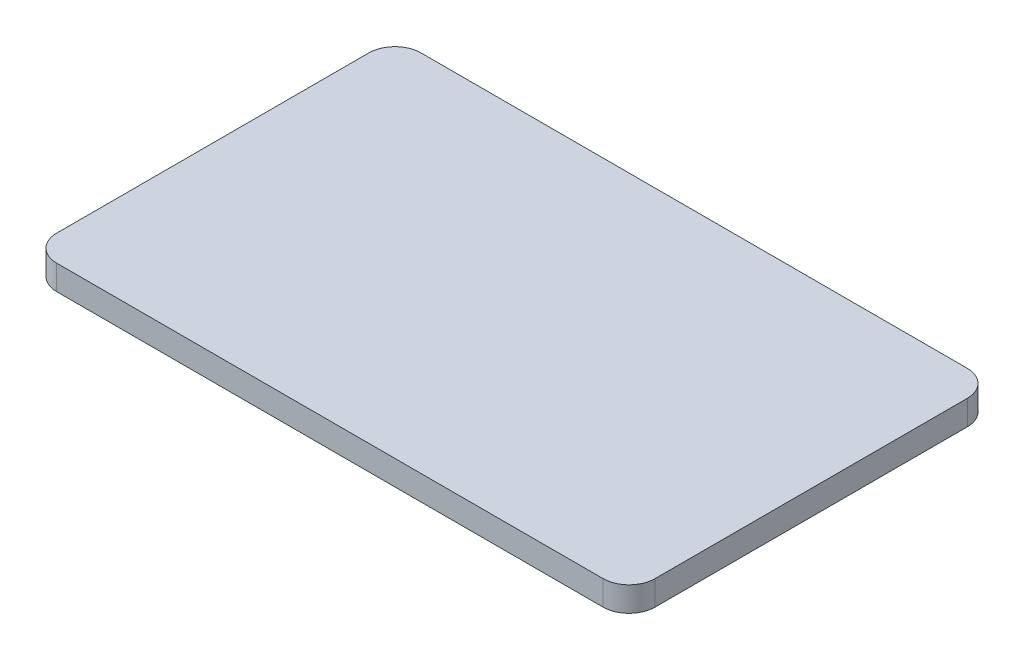
ISO-10303-21;
HEADER;
FILE_DESCRIPTION(('STEP AP214'),'2;1');
FILE_NAME('part.step','',(''),(''),'','','');
FILE_SCHEMA(('AUTOMOTIVE_DESIGN { 1 0 10303 214 1 1 1 1 }'));
ENDSEC;
DATA;
#1=APPLICATION_CONTEXT('core data for automotive mechanical design processes');
#2=APPLICATION_PROTOCOL_DEFINITION('international standard','automotive_design',2000,#1);
#3=PRODUCT_CONTEXT('',#1,'mechanical');
#4=PRODUCT('Part','Part','',(#3));
#5=PRODUCT_RELATED_PRODUCT_CATEGORY('part','',(#4));
#6=PRODUCT_DEFINITION_FORMATION('','',#4);
#7=PRODUCT_DEFINITION_CONTEXT('part definition',#1,'design');
#8=PRODUCT_DEFINITION('design','',#6,#7);
#9=PRODUCT_DEFINITION_SHAPE('','',#8);
#10=(LENGTH_UNIT() NAMED_UNIT(*) SI_UNIT(.MILLI.,.METRE.));
#11=(NAMED_UNIT(*) PLANE_ANGLE_UNIT() SI_UNIT($,.RADIAN.));
#12=(NAMED_UNIT(*) SI_UNIT($,.STERADIAN.) SOLID_ANGLE_UNIT());
#13=UNCERTAINTY_MEASURE_WITH_UNIT(LENGTH_MEASURE(1.E-05),#10,'distance_accuracy_value','');
#14=(GEOMETRIC_REPRESENTATION_CONTEXT(3) GLOBAL_UNCERTAINTY_ASSIGNED_CONTEXT((#13)) GLOBAL_UNIT_ASSIGNED_CONTEXT((#10,
#11,#12)) REPRESENTATION_CONTEXT('',''));
#15=CARTESIAN_POINT('',(0.,0.,0.));
#16=DIRECTION('',(0.,0.,1.));
#17=DIRECTION('',(1.,0.,0.));
#18=AXIS2_PLACEMENT_3D('',#15,#16,#17);
#19=CARTESIAN_POINT('',(0.,1.3,0.));
#20=DIRECTION('',(0.,1.,0.));
#21=DIRECTION('',(0.,0.,1.));
#22=AXIS2_PLACEMENT_3D('',#19,#20,#21);
#23=PLANE('',#22);
#24=DIRECTION('',(0.,0.,1.));
#25=VECTOR('',#24,1.);
#26=CARTESIAN_POINT('',(2.3,1.3,1.2));
#27=LINE('',#26,#25);
#28=CARTESIAN_POINT('',(2.3,1.3,1.2));
#29=VERTEX_POINT('',#28);
#30=CARTESIAN_POINT('',(2.3,1.3,-1.2));
#31=VERTEX_POINT('',#30);
#32=EDGE_CURVE('E108',#29,#31,#27,.F.);
#33=ORIENTED_EDGE('',*,*,#32,.T.);
#34=CARTESIAN_POINT('',(2.1,1.3,-1.2));
#35=DIRECTION('',(0.,-1.,0.));
#36=DIRECTION('',(0.,0.,-1.));
#37=AXIS2_PLACEMENT_3D('',#34,#35,#36);
#38=CIRCLE('',#37,0.2);
#39=CARTESIAN_POINT('',(2.1,1.3,-1.4));
#40=VERTEX_POINT('',#39);
#41=EDGE_CURVE('E110',#40,#31,#38,.T.);
#42=ORIENTED_EDGE('',*,*,#41,.F.);
#43=DIRECTION('',(1.,0.,0.));
#44=VECTOR('',#43,1.);
#45=CARTESIAN_POINT('',(2.1,1.3,-1.4));
#46=LINE('',#45,#44);
#47=CARTESIAN_POINT('',(-2.1,1.3,-1.4));
#48=VERTEX_POINT('',#47);
#49=EDGE_CURVE('E105',#40,#48,#46,.F.);
#50=ORIENTED_EDGE('',*,*,#49,.T.);
#51=CARTESIAN_POINT('',(-2.1,1.3,-1.2));
#52=DIRECTION('',(0.,-1.,0.));
#53=DIRECTION('',(0.,0.,-1.));
#54=AXIS2_PLACEMENT_3D('',#51,#52,#53);
#55=CIRCLE('',#54,0.2);
#56=CARTESIAN_POINT('',(-2.3,1.3,-1.2));
#57=VERTEX_POINT('',#56);
#58=EDGE_CURVE('E92',#57,#48,#55,.T.);
#59=ORIENTED_EDGE('',*,*,#58,.F.);
#60=DIRECTION('',(0.,0.,-1.));
#61=VECTOR('',#60,1.);
#62=CARTESIAN_POINT('',(-2.3,1.3,-1.2));
#63=LINE('',#62,#61);
#64=CARTESIAN_POINT('',(-2.3,1.3,1.2));
#65=VERTEX_POINT('',#64);
#66=EDGE_CURVE('E88',#57,#65,#63,.F.);
#67=ORIENTED_EDGE('',*,*,#66,.T.);
#68=CARTESIAN_POINT('',(-2.1,1.3,1.2));
#69=DIRECTION('',(0.,-1.,0.));
#70=DIRECTION('',(0.,0.,-1.));
#71=AXIS2_PLACEMENT_3D('',#68,#69,#70);
#72=CIRCLE('',#71,0.2);
#73=CARTESIAN_POINT('',(-2.1,1.3,1.4));
#74=VERTEX_POINT('',#73);
#75=EDGE_CURVE('E20',#74,#65,#72,.T.);
#76=ORIENTED_EDGE('',*,*,#75,.F.);
#77=DIRECTION('',(-1.,0.,0.));
#78=VECTOR('',#77,1.);
#79=CARTESIAN_POINT('',(-2.1,1.3,1.4));
#80=LINE('',#79,#78);
#81=CARTESIAN_POINT('',(2.1,1.3,1.4));
#82=VERTEX_POINT('',#81);
#83=EDGE_CURVE('E101',#74,#82,#80,.F.);
#84=ORIENTED_EDGE('',*,*,#83,.T.);
#85=CARTESIAN_POINT('',(2.1,1.3,1.2));
#86=DIRECTION('',(0.,-1.,0.));
#87=DIRECTION('',(0.,0.,-1.));
#88=AXIS2_PLACEMENT_3D('',#85,#86,#87);
#89=CIRCLE('',#88,0.2);
#90=EDGE_CURVE('E112',#29,#82,#89,.T.);
#91=ORIENTED_EDGE('',*,*,#90,.F.);
#92=EDGE_LOOP('',(#33,#42,#50,#59,#67,#76,#84,#91));
#93=FACE_BOUND('',#92,.T.);
#94=ADVANCED_FACE('F17',(#93),#23,.T.);
#95=CARTESIAN_POINT('',(-2.3,7.985164807135,-1.2));
#96=DIRECTION('',(1.,0.,0.));
#97=DIRECTION('',(0.,0.,-1.));
#98=AXIS2_PLACEMENT_3D('',#95,#96,#97);
#99=PLANE('',#98);
#100=DIRECTION('',(0.,-1.,0.));
#101=VECTOR('',#100,1.);
#102=CARTESIAN_POINT('',(-2.3,7.985164807135,-1.2));
#103=LINE('',#102,#101);
#104=CARTESIAN_POINT('',(-2.3,1.11,-1.2));
#105=VERTEX_POINT('',#104);
#106=EDGE_CURVE('E136',#105,#57,#103,.F.);
#107=ORIENTED_EDGE('',*,*,#106,.F.);
#108=DIRECTION('',(0.,0.,1.));
#109=VECTOR('',#108,1.);
#110=CARTESIAN_POINT('',(-2.3,1.11,-1.2));
#111=LINE('',#110,#109);
#112=CARTESIAN_POINT('',(-2.3,1.11,1.2));
#113=VERTEX_POINT('',#112);
#114=EDGE_CURVE('E99',#105,#113,#111,.T.);
#115=ORIENTED_EDGE('',*,*,#114,.T.);
#116=DIRECTION('',(0.,-1.,0.));
#117=VECTOR('',#116,1.);
#118=CARTESIAN_POINT('',(-2.3,7.985164807135,1.2));
#119=LINE('',#118,#117);
#120=EDGE_CURVE('E85',#65,#113,#119,.T.);
#121=ORIENTED_EDGE('',*,*,#120,.F.);
#122=ORIENTED_EDGE('',*,*,#66,.F.);
#123=EDGE_LOOP('',(#107,#115,#121,#122));
#124=FACE_BOUND('',#123,.T.);
#125=ADVANCED_FACE('F98',(#124),#99,.F.);
#126=CARTESIAN_POINT('',(-2.1,7.985164807135,1.2));
#127=DIRECTION('',(0.,-1.,0.));
#128=DIRECTION('',(0.,0.,-1.));
#129=AXIS2_PLACEMENT_3D('',#126,#127,#128);
#130=CYLINDRICAL_SURFACE('',#129,0.2);
#131=CARTESIAN_POINT('',(-2.1,1.11,1.2));
#132=DIRECTION('',(0.,-1.,0.));
#133=DIRECTION('',(0.,0.,-1.));
#134=AXIS2_PLACEMENT_3D('',#131,#132,#133);
#135=CIRCLE('',#134,0.2);
#136=CARTESIAN_POINT('',(-2.1,1.11,1.4));
#137=VERTEX_POINT('',#136);
#138=EDGE_CURVE('E122',#113,#137,#135,.F.);
#139=ORIENTED_EDGE('',*,*,#138,.T.);
#140=DIRECTION('',(0.,1.,0.));
#141=VECTOR('',#140,1.);
#142=CARTESIAN_POINT('',(-2.1,7.985164807135,1.4));
#143=LINE('',#142,#141);
#144=EDGE_CURVE('E87',#137,#74,#143,.T.);
#145=ORIENTED_EDGE('',*,*,#144,.T.);
#146=ORIENTED_EDGE('',*,*,#75,.T.);
#147=ORIENTED_EDGE('',*,*,#120,.T.);
#148=EDGE_LOOP('',(#139,#145,#146,#147));
#149=FACE_BOUND('',#148,.T.);
#150=ADVANCED_FACE('F83',(#149),#130,.T.);
#151=CARTESIAN_POINT('',(-2.1,7.985164807135,1.4));
#152=DIRECTION('',(0.,0.,-1.));
#153=DIRECTION('',(-1.,0.,0.));
#154=AXIS2_PLACEMENT_3D('',#151,#152,#153);
#155=PLANE('',#154);
#156=ORIENTED_EDGE('',*,*,#144,.F.);
#157=DIRECTION('',(1.,0.,0.));
#158=VECTOR('',#157,1.);
#159=CARTESIAN_POINT('',(-2.1,1.11,1.4));
#160=LINE('',#159,#158);
#161=CARTESIAN_POINT('',(2.1,1.11,1.4));
#162=VERTEX_POINT('',#161);
#163=EDGE_CURVE('E121',#137,#162,#160,.T.);
#164=ORIENTED_EDGE('',*,*,#163,.T.);
#165=DIRECTION('',(0.,-1.,0.));
#166=VECTOR('',#165,1.);
#167=CARTESIAN_POINT('',(2.1,7.985164807135,1.4));
#168=LINE('',#167,#166);
#169=EDGE_CURVE('E126',#82,#162,#168,.T.);
#170=ORIENTED_EDGE('',*,*,#169,.F.);
#171=ORIENTED_EDGE('',*,*,#83,.F.);
#172=EDGE_LOOP('',(#156,#164,#170,#171));
#173=FACE_BOUND('',#172,.T.);
#174=ADVANCED_FACE('F162',(#173),#155,.F.);
#175=CARTESIAN_POINT('',(2.1,7.985164807135,1.2));
#176=DIRECTION('',(0.,-1.,0.));
#177=DIRECTION('',(0.,0.,-1.));
#178=AXIS2_PLACEMENT_3D('',#175,#176,#177);
#179=CYLINDRICAL_SURFACE('',#178,0.2);
#180=CARTESIAN_POINT('',(2.1,1.11,1.2));
#181=DIRECTION('',(0.,-1.,0.));
#182=DIRECTION('',(0.,0.,-1.));
#183=AXIS2_PLACEMENT_3D('',#180,#181,#182);
#184=CIRCLE('',#183,0.2);
#185=CARTESIAN_POINT('',(2.3,1.11,1.2));
#186=VERTEX_POINT('',#185);
#187=EDGE_CURVE('E118',#162,#186,#184,.F.);
#188=ORIENTED_EDGE('',*,*,#187,.T.);
#189=DIRECTION('',(0.,1.,0.));
#190=VECTOR('',#189,1.);
#191=CARTESIAN_POINT('',(2.3,7.985164807135,1.2));
#192=LINE('',#191,#190);
#193=EDGE_CURVE('E111',#186,#29,#192,.T.);
#194=ORIENTED_EDGE('',*,*,#193,.T.);
#195=ORIENTED_EDGE('',*,*,#90,.T.);
#196=ORIENTED_EDGE('',*,*,#169,.T.);
#197=EDGE_LOOP('',(#188,#194,#195,#196));
#198=FACE_BOUND('',#197,.T.);
#199=ADVANCED_FACE('F160',(#198),#179,.T.);
#200=CARTESIAN_POINT('',(2.3,7.985164807135,1.2));
#201=DIRECTION('',(-1.,0.,0.));
#202=DIRECTION('',(0.,0.,1.));
#203=AXIS2_PLACEMENT_3D('',#200,#201,#202);
#204=PLANE('',#203);
#205=ORIENTED_EDGE('',*,*,#193,.F.);
#206=DIRECTION('',(0.,0.,1.));
#207=VECTOR('',#206,1.);
#208=CARTESIAN_POINT('',(2.3,1.11,-1.2));
#209=LINE('',#208,#207);
#210=CARTESIAN_POINT('',(2.3,1.11,-1.2));
#211=VERTEX_POINT('',#210);
#212=EDGE_CURVE('E117',#186,#211,#209,.F.);
#213=ORIENTED_EDGE('',*,*,#212,.T.);
#214=DIRECTION('',(0.,-1.,0.));
#215=VECTOR('',#214,1.);
#216=CARTESIAN_POINT('',(2.3,7.985164807135,-1.2));
#217=LINE('',#216,#215);
#218=EDGE_CURVE('E125',#31,#211,#217,.T.);
#219=ORIENTED_EDGE('',*,*,#218,.F.);
#220=ORIENTED_EDGE('',*,*,#32,.F.);
#221=EDGE_LOOP('',(#205,#213,#219,#220));
#222=FACE_BOUND('',#221,.T.);
#223=ADVANCED_FACE('F158',(#222),#204,.F.);
#224=CARTESIAN_POINT('',(2.1,7.985164807135,-1.2));
#225=DIRECTION('',(0.,-1.,0.));
#226=DIRECTION('',(0.,0.,-1.));
#227=AXIS2_PLACEMENT_3D('',#224,#225,#226);
#228=CYLINDRICAL_SURFACE('',#227,0.2);
#229=CARTESIAN_POINT('',(2.1,1.11,-1.2));
#230=DIRECTION('',(0.,-1.,0.));
#231=DIRECTION('',(0.,0.,-1.));
#232=AXIS2_PLACEMENT_3D('',#229,#230,#231);
#233=CIRCLE('',#232,0.2);
#234=CARTESIAN_POINT('',(2.1,1.11,-1.4));
#235=VERTEX_POINT('',#234);
#236=EDGE_CURVE('E114',#211,#235,#233,.F.);
#237=ORIENTED_EDGE('',*,*,#236,.T.);
#238=DIRECTION('',(0.,1.,0.));
#239=VECTOR('',#238,1.);
#240=CARTESIAN_POINT('',(2.1,7.985164807135,-1.4));
#241=LINE('',#240,#239);
#242=EDGE_CURVE('E107',#235,#40,#241,.T.);
#243=ORIENTED_EDGE('',*,*,#242,.T.);
#244=ORIENTED_EDGE('',*,*,#41,.T.);
#245=ORIENTED_EDGE('',*,*,#218,.T.);
#246=EDGE_LOOP('',(#237,#243,#244,#245));
#247=FACE_BOUND('',#246,.T.);
#248=ADVANCED_FACE('F154',(#247),#228,.T.);
#249=CARTESIAN_POINT('',(2.1,7.985164807135,-1.4));
#250=DIRECTION('',(0.,0.,1.));
#251=DIRECTION('',(1.,0.,0.));
#252=AXIS2_PLACEMENT_3D('',#249,#250,#251);
#253=PLANE('',#252);
#254=ORIENTED_EDGE('',*,*,#242,.F.);
#255=DIRECTION('',(1.,0.,0.));
#256=VECTOR('',#255,1.);
#257=CARTESIAN_POINT('',(-2.1,1.11,-1.4));
#258=LINE('',#257,#256);
#259=CARTESIAN_POINT('',(-2.1,1.11,-1.4));
#260=VERTEX_POINT('',#259);
#261=EDGE_CURVE('E26',#235,#260,#258,.F.);
#262=ORIENTED_EDGE('',*,*,#261,.T.);
#263=DIRECTION('',(0.,-1.,0.));
#264=VECTOR('',#263,1.);
#265=CARTESIAN_POINT('',(-2.1,7.985164807135,-1.4));
#266=LINE('',#265,#264);
#267=EDGE_CURVE('E34',#48,#260,#266,.T.);
#268=ORIENTED_EDGE('',*,*,#267,.F.);
#269=ORIENTED_EDGE('',*,*,#49,.F.);
#270=EDGE_LOOP('',(#254,#262,#268,#269));
#271=FACE_BOUND('',#270,.T.);
#272=ADVANCED_FACE('F147',(#271),#253,.F.);
#273=CARTESIAN_POINT('',(-2.1,7.985164807135,-1.2));
#274=DIRECTION('',(0.,-1.,0.));
#275=DIRECTION('',(0.,0.,-1.));
#276=AXIS2_PLACEMENT_3D('',#273,#274,#275);
#277=CYLINDRICAL_SURFACE('',#276,0.2);
#278=CARTESIAN_POINT('',(-2.1,1.11,-1.2));
#279=DIRECTION('',(0.,-1.,0.));
#280=DIRECTION('',(0.,0.,-1.));
#281=AXIS2_PLACEMENT_3D('',#278,#279,#280);
#282=CIRCLE('',#281,0.2);
#283=EDGE_CURVE('E11',#260,#105,#282,.F.);
#284=ORIENTED_EDGE('',*,*,#283,.T.);
#285=ORIENTED_EDGE('',*,*,#106,.T.);
#286=ORIENTED_EDGE('',*,*,#58,.T.);
#287=ORIENTED_EDGE('',*,*,#267,.T.);
#288=EDGE_LOOP('',(#284,#285,#286,#287));
#289=FACE_BOUND('',#288,.T.);
#290=ADVANCED_FACE('F173',(#289),#277,.T.);
#291=CARTESIAN_POINT('',(-2.1,1.11,-1.2));
#292=DIRECTION('',(0.,1.,0.));
#293=DIRECTION('',(0.,0.,1.));
#294=AXIS2_PLACEMENT_3D('',#291,#292,#293);
#295=PLANE('',#294);
#296=ORIENTED_EDGE('',*,*,#261,.F.);
#297=ORIENTED_EDGE('',*,*,#236,.F.);
#298=ORIENTED_EDGE('',*,*,#212,.F.);
#299=ORIENTED_EDGE('',*,*,#187,.F.);
#300=ORIENTED_EDGE('',*,*,#163,.F.);
#301=ORIENTED_EDGE('',*,*,#138,.F.);
#302=ORIENTED_EDGE('',*,*,#114,.F.);
#303=ORIENTED_EDGE('',*,*,#283,.F.);
#304=EDGE_LOOP('',(#296,#297,#298,#299,#300,#301,#302,#303));
#305=FACE_BOUND('',#304,.T.);
#306=ADVANCED_FACE('F151',(#305),#295,.F.);
#307=CLOSED_SHELL('',(#94,#125,#150,#174,#199,#223,#248,#272,#290,#306));
#308=MANIFOLD_SOLID_BREP('B1',#307);
#309=ADVANCED_BREP_SHAPE_REPRESENTATION('',(#18,#308),#14);
#310=SHAPE_DEFINITION_REPRESENTATION(#9,#309);
ENDSEC;
END-ISO-10303-21;
